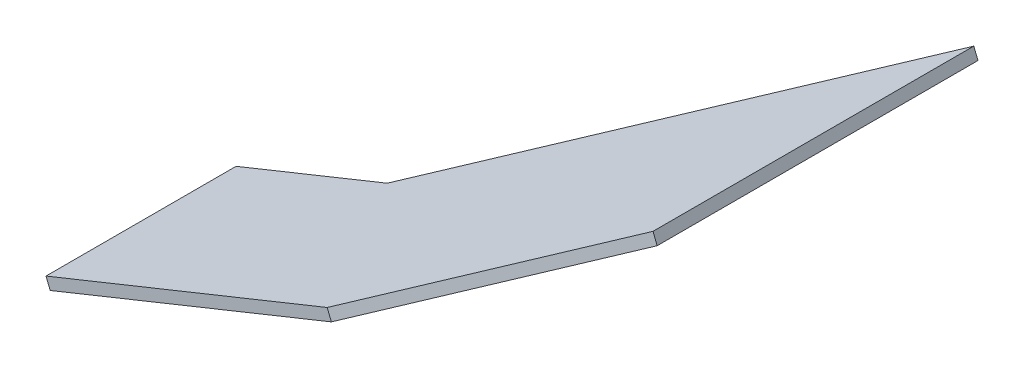
ISO-10303-21;
HEADER;
FILE_DESCRIPTION(('STEP AP214'),'2;1');
FILE_NAME('part.step','',(''),(''),'','','');
FILE_SCHEMA(('AUTOMOTIVE_DESIGN { 1 0 10303 214 1 1 1 1 }'));
ENDSEC;
DATA;
#1=APPLICATION_CONTEXT('core data for automotive mechanical design processes');
#2=APPLICATION_PROTOCOL_DEFINITION('international standard','automotive_design',2000,#1);
#3=PRODUCT_CONTEXT('',#1,'mechanical');
#4=PRODUCT('Part','Part','',(#3));
#5=PRODUCT_RELATED_PRODUCT_CATEGORY('part','',(#4));
#6=PRODUCT_DEFINITION_FORMATION('','',#4);
#7=PRODUCT_DEFINITION_CONTEXT('part definition',#1,'design');
#8=PRODUCT_DEFINITION('design','',#6,#7);
#9=PRODUCT_DEFINITION_SHAPE('','',#8);
#10=(LENGTH_UNIT() NAMED_UNIT(*) SI_UNIT(.MILLI.,.METRE.));
#11=(NAMED_UNIT(*) PLANE_ANGLE_UNIT() SI_UNIT($,.RADIAN.));
#12=(NAMED_UNIT(*) SI_UNIT($,.STERADIAN.) SOLID_ANGLE_UNIT());
#13=UNCERTAINTY_MEASURE_WITH_UNIT(LENGTH_MEASURE(1.E-05),#10,'distance_accuracy_value','');
#14=(GEOMETRIC_REPRESENTATION_CONTEXT(3) GLOBAL_UNCERTAINTY_ASSIGNED_CONTEXT((#13)) GLOBAL_UNIT_ASSIGNED_CONTEXT((#10,
#11,#12)) REPRESENTATION_CONTEXT('',''));
#15=CARTESIAN_POINT('',(0.,0.,0.));
#16=DIRECTION('',(0.,0.,1.));
#17=DIRECTION('',(1.,0.,0.));
#18=AXIS2_PLACEMENT_3D('',#15,#16,#17);
#19=CARTESIAN_POINT('',(5931.62175472786,3391.74290616625,-11775.4490119966));
#20=DIRECTION('',(-2.98023642431578E-11,7.61419999252645E-11,-1.));
#21=DIRECTION('',(0.,1.,7.61419999252645E-11));
#22=AXIS2_PLACEMENT_3D('',#19,#20,#21);
#23=PLANE('',#22);
#24=DIRECTION('',(-0.927453921512789,-0.373937459303757,-8.32026410690993E-13));
#25=VECTOR('',#24,1.);
#26=CARTESIAN_POINT('',(5930.49994234994,3394.52526793079,-11775.4490119964));
#27=LINE('',#26,#25);
#28=CARTESIAN_POINT('',(5930.49994234994,3394.52526793079,-11775.4490119964));
#29=VERTEX_POINT('',#28);
#30=CARTESIAN_POINT('',(5855.25643369389,3364.18805569489,-11775.4490119964));
#31=VERTEX_POINT('',#30);
#32=EDGE_CURVE('E117',#29,#31,#27,.T.);
#33=ORIENTED_EDGE('',*,*,#32,.T.);
#34=DIRECTION('',(-0.373937459303757,0.927453921512789,8.17624167888446E-11));
#35=VECTOR('',#34,1.);
#36=CARTESIAN_POINT('',(5856.3782460718,3361.40569393035,-11775.4490119967));
#37=LINE('',#36,#35);
#38=CARTESIAN_POINT('',(5856.3782460718,3361.40569393035,-11775.4490119967));
#39=VERTEX_POINT('',#38);
#40=EDGE_CURVE('E11',#39,#31,#37,.T.);
#41=ORIENTED_EDGE('',*,*,#40,.F.);
#42=DIRECTION('',(-0.927453921512789,-0.373937459303757,-8.32026410690993E-13));
#43=VECTOR('',#42,1.);
#44=CARTESIAN_POINT('',(5931.62175472786,3391.74290616625,-11775.4490119966));
#45=LINE('',#44,#43);
#46=CARTESIAN_POINT('',(5931.62175472786,3391.74290616625,-11775.4490119966));
#47=VERTEX_POINT('',#46);
#48=EDGE_CURVE('E127',#47,#39,#45,.T.);
#49=ORIENTED_EDGE('',*,*,#48,.F.);
#50=DIRECTION('',(-0.373937459303757,0.927453921512789,8.17624167888446E-11));
#51=VECTOR('',#50,1.);
#52=CARTESIAN_POINT('',(5931.62175472786,3391.74290616625,-11775.4490119966));
#53=LINE('',#52,#51);
#54=EDGE_CURVE('E113',#47,#29,#53,.T.);
#55=ORIENTED_EDGE('',*,*,#54,.T.);
#56=EDGE_LOOP('',(#33,#41,#49,#55));
#57=FACE_BOUND('',#56,.T.);
#58=ADVANCED_FACE('F33',(#57),#23,.F.);
#59=CARTESIAN_POINT('',(5856.3782460718,3361.40569393035,-11775.4490119967));
#60=DIRECTION('',(0.927453921512789,0.373937459303757,8.43759271380557E-13));
#61=DIRECTION('',(-0.373937459303757,0.927453921512789,0.));
#62=AXIS2_PLACEMENT_3D('',#59,#60,#61);
#63=PLANE('',#62);
#64=DIRECTION('',(-2.97913047013198E-11,7.61459461606712E-11,-1.));
#65=VECTOR('',#64,1.);
#66=CARTESIAN_POINT('',(5855.25643369389,3364.18805569489,-11775.4490119964));
#67=LINE('',#66,#65);
#68=CARTESIAN_POINT('',(5855.25643369237,3364.18805569876,-11826.3105771142));
#69=VERTEX_POINT('',#68);
#70=EDGE_CURVE('E120',#31,#69,#67,.T.);
#71=ORIENTED_EDGE('',*,*,#70,.T.);
#72=DIRECTION('',(-0.373937459303757,0.927453921512789,8.17624167888446E-11));
#73=VECTOR('',#72,1.);
#74=CARTESIAN_POINT('',(5856.37824607028,3361.40569393423,-11826.3105771144));
#75=LINE('',#74,#73);
#76=CARTESIAN_POINT('',(5856.37824607028,3361.40569393423,-11826.3105771144));
#77=VERTEX_POINT('',#76);
#78=EDGE_CURVE('E41',#77,#69,#75,.T.);
#79=ORIENTED_EDGE('',*,*,#78,.F.);
#80=DIRECTION('',(-2.97913047013198E-11,7.61459461606712E-11,-1.));
#81=VECTOR('',#80,1.);
#82=CARTESIAN_POINT('',(5856.3782460718,3361.40569393035,-11775.4490119967));
#83=LINE('',#82,#81);
#84=EDGE_CURVE('E86',#39,#77,#83,.T.);
#85=ORIENTED_EDGE('',*,*,#84,.F.);
#86=ORIENTED_EDGE('',*,*,#40,.T.);
#87=EDGE_LOOP('',(#71,#79,#85,#86));
#88=FACE_BOUND('',#87,.T.);
#89=ADVANCED_FACE('F151',(#88),#63,.F.);
#90=CARTESIAN_POINT('',(5856.37824607028,3361.40569393423,-11826.3105771144));
#91=DIRECTION('',(2.98562416728005E-11,-7.61202772405175E-11,1.));
#92=DIRECTION('',(0.,-1.,-7.61202772405175E-11));
#93=AXIS2_PLACEMENT_3D('',#90,#91,#92);
#94=PLANE('',#93);
#95=DIRECTION('',(0.927453921512786,0.373937459303765,7.73934651744996E-13));
#96=VECTOR('',#95,1.);
#97=CARTESIAN_POINT('',(5855.25643369237,3364.18805569876,-11826.3105771142));
#98=LINE('',#97,#96);
#99=CARTESIAN_POINT('',(5895.70208778845,3380.4952217819,-11826.3105771141));
#100=VERTEX_POINT('',#99);
#101=EDGE_CURVE('E122',#69,#100,#98,.T.);
#102=ORIENTED_EDGE('',*,*,#101,.T.);
#103=DIRECTION('',(-0.373937459303757,0.927453921512789,8.17624167888446E-11));
#104=VECTOR('',#103,1.);
#105=CARTESIAN_POINT('',(5896.82390016636,3377.71286001737,-11826.3105771144));
#106=LINE('',#105,#104);
#107=CARTESIAN_POINT('',(5896.82390016636,3377.71286001737,-11826.3105771144));
#108=VERTEX_POINT('',#107);
#109=EDGE_CURVE('E108',#108,#100,#106,.T.);
#110=ORIENTED_EDGE('',*,*,#109,.F.);
#111=DIRECTION('',(0.927453921512786,0.373937459303765,7.73934651744996E-13));
#112=VECTOR('',#111,1.);
#113=CARTESIAN_POINT('',(5856.37824607028,3361.40569393423,-11826.3105771144));
#114=LINE('',#113,#112);
#115=EDGE_CURVE('E99',#77,#108,#114,.T.);
#116=ORIENTED_EDGE('',*,*,#115,.F.);
#117=ORIENTED_EDGE('',*,*,#78,.T.);
#118=EDGE_LOOP('',(#102,#110,#116,#117));
#119=FACE_BOUND('',#118,.T.);
#120=ADVANCED_FACE('F133',(#119),#94,.F.);
#121=CARTESIAN_POINT('',(5896.82390016636,3377.71286001737,-11826.3105771144));
#122=DIRECTION('',(0.632522053526999,0.255024733955391,0.731353701619791));
#123=DIRECTION('',(0.756363206629756,0.,-0.654151893413719));
#124=AXIS2_PLACEMENT_3D('',#121,#122,#123);
#125=PLANE('',#124);
#126=DIRECTION('',(0.678296858559318,0.273480545087821,-0.681998360061833));
#127=VECTOR('',#126,1.);
#128=CARTESIAN_POINT('',(5895.70208778845,3380.4952217819,-11826.3105771141));
#129=LINE('',#128,#127);
#130=CARTESIAN_POINT('',(5973.97053564199,3412.05205049496,-11905.0061399892));
#131=VERTEX_POINT('',#130);
#132=EDGE_CURVE('E107',#100,#131,#129,.T.);
#133=ORIENTED_EDGE('',*,*,#132,.T.);
#134=DIRECTION('',(-0.373937459303757,0.927453921512789,8.17624167888446E-11));
#135=VECTOR('',#134,1.);
#136=CARTESIAN_POINT('',(5975.0923480199,3409.26968873043,-11905.0061399894));
#137=LINE('',#136,#135);
#138=CARTESIAN_POINT('',(5975.0923480199,3409.26968873043,-11905.0061399894));
#139=VERTEX_POINT('',#138);
#140=EDGE_CURVE('E104',#139,#131,#137,.T.);
#141=ORIENTED_EDGE('',*,*,#140,.F.);
#142=DIRECTION('',(0.678296858559318,0.273480545087821,-0.681998360061833));
#143=VECTOR('',#142,1.);
#144=CARTESIAN_POINT('',(5896.82390016636,3377.71286001737,-11826.3105771144));
#145=LINE('',#144,#143);
#146=EDGE_CURVE('E93',#108,#139,#145,.T.);
#147=ORIENTED_EDGE('',*,*,#146,.F.);
#148=ORIENTED_EDGE('',*,*,#109,.T.);
#149=EDGE_LOOP('',(#133,#141,#147,#148));
#150=FACE_BOUND('',#149,.T.);
#151=ADVANCED_FACE('F105',(#150),#125,.F.);
#152=CARTESIAN_POINT('',(5975.0923480199,3409.26968873043,-11905.0061399894));
#153=DIRECTION('',(-0.927453921512789,-0.373937459303757,-8.39171406188417E-13));
#154=DIRECTION('',(0.373937459303757,-0.927453921512789,0.));
#155=AXIS2_PLACEMENT_3D('',#152,#153,#154);
#156=PLANE('',#155);
#157=DIRECTION('',(2.97958568059752E-11,-7.61449673930477E-11,1.));
#158=VECTOR('',#157,1.);
#159=CARTESIAN_POINT('',(5973.97053564199,3412.05205049496,-11905.0061399892));
#160=LINE('',#159,#158);
#161=CARTESIAN_POINT('',(5973.97053564455,3412.05205048843,-11819.1568265966));
#162=VERTEX_POINT('',#161);
#163=EDGE_CURVE('E72',#131,#162,#160,.T.);
#164=ORIENTED_EDGE('',*,*,#163,.T.);
#165=DIRECTION('',(-0.373937459303757,0.927453921512789,8.17624167888446E-11));
#166=VECTOR('',#165,1.);
#167=CARTESIAN_POINT('',(5975.09234802246,3409.26968872389,-11819.1568265969));
#168=LINE('',#167,#166);
#169=CARTESIAN_POINT('',(5975.09234802246,3409.26968872389,-11819.1568265969));
#170=VERTEX_POINT('',#169);
#171=EDGE_CURVE('E109',#170,#162,#168,.T.);
#172=ORIENTED_EDGE('',*,*,#171,.F.);
#173=DIRECTION('',(2.97958568059752E-11,-7.61449673930477E-11,1.));
#174=VECTOR('',#173,1.);
#175=CARTESIAN_POINT('',(5975.0923480199,3409.26968873043,-11905.0061399894));
#176=LINE('',#175,#174);
#177=EDGE_CURVE('E97',#139,#170,#176,.T.);
#178=ORIENTED_EDGE('',*,*,#177,.F.);
#179=ORIENTED_EDGE('',*,*,#140,.T.);
#180=EDGE_LOOP('',(#164,#172,#178,#179));
#181=FACE_BOUND('',#180,.T.);
#182=ADVANCED_FACE('F111',(#181),#156,.F.);
#183=CARTESIAN_POINT('',(5975.09234802246,3409.26968872389,-11819.1568265969));
#184=DIRECTION('',(-0.632522053526998,-0.255024733955391,-0.731353701619792));
#185=DIRECTION('',(-0.756363206629756,0.,0.654151893413718));
#186=AXIS2_PLACEMENT_3D('',#183,#184,#185);
#187=PLANE('',#186);
#188=DIRECTION('',(-0.678296858559316,-0.273480545087827,0.681998360061832));
#189=VECTOR('',#188,1.);
#190=CARTESIAN_POINT('',(5973.97053564455,3412.05205048843,-11819.1568265966));
#191=LINE('',#190,#189);
#192=EDGE_CURVE('E78',#162,#29,#191,.T.);
#193=ORIENTED_EDGE('',*,*,#192,.T.);
#194=ORIENTED_EDGE('',*,*,#54,.F.);
#195=DIRECTION('',(-0.678296858559316,-0.273480545087827,0.681998360061832));
#196=VECTOR('',#195,1.);
#197=CARTESIAN_POINT('',(5975.09234802246,3409.26968872389,-11819.1568265969));
#198=LINE('',#197,#196);
#199=EDGE_CURVE('E49',#170,#47,#198,.T.);
#200=ORIENTED_EDGE('',*,*,#199,.F.);
#201=ORIENTED_EDGE('',*,*,#171,.T.);
#202=EDGE_LOOP('',(#193,#194,#200,#201));
#203=FACE_BOUND('',#202,.T.);
#204=ADVANCED_FACE('F140',(#203),#187,.F.);
#205=CARTESIAN_POINT('',(-346.875489307669,860.333793340916,7.58448026764512E-08));
#206=DIRECTION('',(0.373937459303757,-0.927453921512789,-8.17619411633719E-11));
#207=DIRECTION('',(0.927453921512789,0.373937459303757,0.));
#208=AXIS2_PLACEMENT_3D('',#205,#206,#207);
#209=PLANE('',#208);
#210=ORIENTED_EDGE('',*,*,#48,.T.);
#211=ORIENTED_EDGE('',*,*,#84,.T.);
#212=ORIENTED_EDGE('',*,*,#115,.T.);
#213=ORIENTED_EDGE('',*,*,#146,.T.);
#214=ORIENTED_EDGE('',*,*,#177,.T.);
#215=ORIENTED_EDGE('',*,*,#199,.T.);
#216=EDGE_LOOP('',(#210,#211,#212,#213,#214,#215));
#217=FACE_BOUND('',#216,.T.);
#218=ADVANCED_FACE('F95',(#217),#209,.T.);
#219=CARTESIAN_POINT('',(-347.99730168558,863.116155105454,7.60900899268177E-08));
#220=DIRECTION('',(0.373937459303757,-0.927453921512789,-8.17619411633719E-11));
#221=DIRECTION('',(0.927453921512789,0.373937459303757,0.));
#222=AXIS2_PLACEMENT_3D('',#219,#220,#221);
#223=PLANE('',#222);
#224=ORIENTED_EDGE('',*,*,#32,.F.);
#225=ORIENTED_EDGE('',*,*,#192,.F.);
#226=ORIENTED_EDGE('',*,*,#163,.F.);
#227=ORIENTED_EDGE('',*,*,#132,.F.);
#228=ORIENTED_EDGE('',*,*,#101,.F.);
#229=ORIENTED_EDGE('',*,*,#70,.F.);
#230=EDGE_LOOP('',(#224,#225,#226,#227,#228,#229));
#231=FACE_BOUND('',#230,.T.);
#232=ADVANCED_FACE('F136',(#231),#223,.F.);
#233=CLOSED_SHELL('',(#58,#89,#120,#151,#182,#204,#218,#232));
#234=MANIFOLD_SOLID_BREP('B2',#233);
#235=ADVANCED_BREP_SHAPE_REPRESENTATION('',(#18,#234),#14);
#236=SHAPE_DEFINITION_REPRESENTATION(#9,#235);
ENDSEC;
END-ISO-10303-21;
